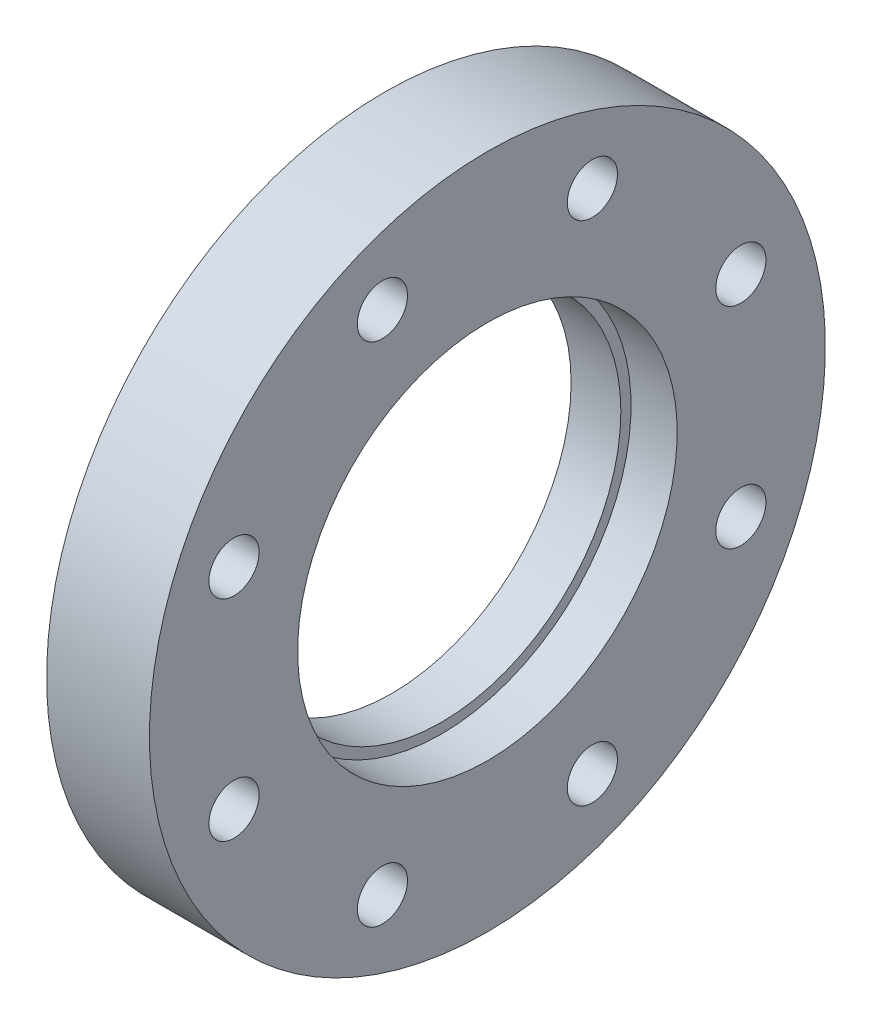
ISO-10303-21;
HEADER;
FILE_DESCRIPTION(('STEP AP214'),'2;1');
FILE_NAME('part.step','',(''),(''),'','','');
FILE_SCHEMA(('AUTOMOTIVE_DESIGN { 1 0 10303 214 1 1 1 1 }'));
ENDSEC;
DATA;
#1=APPLICATION_CONTEXT('core data for automotive mechanical design processes');
#2=APPLICATION_PROTOCOL_DEFINITION('international standard','automotive_design',2000,#1);
#3=PRODUCT_CONTEXT('',#1,'mechanical');
#4=PRODUCT('Part','Part','',(#3));
#5=PRODUCT_RELATED_PRODUCT_CATEGORY('part','',(#4));
#6=PRODUCT_DEFINITION_FORMATION('','',#4);
#7=PRODUCT_DEFINITION_CONTEXT('part definition',#1,'design');
#8=PRODUCT_DEFINITION('design','',#6,#7);
#9=PRODUCT_DEFINITION_SHAPE('','',#8);
#10=(LENGTH_UNIT() NAMED_UNIT(*) SI_UNIT(.MILLI.,.METRE.));
#11=(NAMED_UNIT(*) PLANE_ANGLE_UNIT() SI_UNIT($,.RADIAN.));
#12=(NAMED_UNIT(*) SI_UNIT($,.STERADIAN.) SOLID_ANGLE_UNIT());
#13=UNCERTAINTY_MEASURE_WITH_UNIT(LENGTH_MEASURE(1.E-05),#10,'distance_accuracy_value','');
#14=(GEOMETRIC_REPRESENTATION_CONTEXT(3) GLOBAL_UNCERTAINTY_ASSIGNED_CONTEXT((#13)) GLOBAL_UNIT_ASSIGNED_CONTEXT((#10,
#11,#12)) REPRESENTATION_CONTEXT('',''));
#15=CARTESIAN_POINT('',(0.,0.,0.));
#16=DIRECTION('',(0.,0.,1.));
#17=DIRECTION('',(1.,0.,0.));
#18=AXIS2_PLACEMENT_3D('',#15,#16,#17);
#19=CARTESIAN_POINT('',(0.893707741295802,0.,0.));
#20=DIRECTION('',(1.,0.,0.));
#21=DIRECTION('',(0.,1.,0.));
#22=AXIS2_PLACEMENT_3D('',#19,#20,#21);
#23=CYLINDRICAL_SURFACE('',#22,38.608);
#24=CARTESIAN_POINT('',(1.1700000000003,0.,0.));
#25=DIRECTION('',(1.,0.,0.));
#26=DIRECTION('',(0.,1.,0.));
#27=AXIS2_PLACEMENT_3D('',#24,#25,#26);
#28=CIRCLE('',#27,38.608);
#29=CARTESIAN_POINT('',(1.17000000000035,38.608,0.));
#30=VERTEX_POINT('',#29);
#31=EDGE_CURVE('E19',#30,#30,#28,.F.);
#32=ORIENTED_EDGE('',*,*,#31,.F.);
#33=EDGE_LOOP('',(#32));
#34=FACE_BOUND('',#33,.T.);
#35=CARTESIAN_POINT('',(0.617415480729711,0.,0.));
#36=DIRECTION('',(1.,0.,0.));
#37=DIRECTION('',(0.,1.,0.));
#38=AXIS2_PLACEMENT_3D('',#35,#36,#37);
#39=CIRCLE('',#38,38.6080000006776);
#40=CARTESIAN_POINT('',(0.617415480729764,38.6080000006776,0.));
#41=VERTEX_POINT('',#40);
#42=EDGE_CURVE('E102',#41,#41,#39,.T.);
#43=ORIENTED_EDGE('',*,*,#42,.F.);
#44=EDGE_LOOP('',(#43));
#45=FACE_BOUND('',#44,.T.);
#46=ADVANCED_FACE('F15',(#34,#45),#23,.F.);
#47=CARTESIAN_POINT('',(1.58812409924042,0.,0.));
#48=DIRECTION('',(1.,0.,0.));
#49=DIRECTION('',(0.,1.,0.));
#50=AXIS2_PLACEMENT_3D('',#47,#48,#49);
#51=CONICAL_SURFACE('',#50,41.2749999993224,1.22173047500015);
#52=ORIENTED_EDGE('',*,*,#42,.T.);
#53=EDGE_LOOP('',(#52));
#54=FACE_BOUND('',#53,.T.);
#55=CARTESIAN_POINT('',(1.58812409737882,0.,0.));
#56=DIRECTION('',(1.,0.,0.));
#57=DIRECTION('',(0.,1.,0.));
#58=AXIS2_PLACEMENT_3D('',#55,#56,#57);
#59=CIRCLE('',#58,41.275);
#60=CARTESIAN_POINT('',(1.58812409737888,41.275,0.));
#61=VERTEX_POINT('',#60);
#62=EDGE_CURVE('E94',#61,#61,#59,.F.);
#63=ORIENTED_EDGE('',*,*,#62,.T.);
#64=EDGE_LOOP('',(#63));
#65=FACE_BOUND('',#64,.T.);
#66=ADVANCED_FACE('F108',(#54,#65),#51,.T.);
#67=CARTESIAN_POINT('',(1.17000000000035,34.38525,0.));
#68=DIRECTION('',(-1.,0.,0.));
#69=DIRECTION('',(0.,0.,1.));
#70=AXIS2_PLACEMENT_3D('',#67,#68,#69);
#71=PLANE('',#70);
#72=CARTESIAN_POINT('',(1.17000000000031,0.,0.));
#73=DIRECTION('',(1.,0.,0.));
#74=DIRECTION('',(0.,1.,0.));
#75=AXIS2_PLACEMENT_3D('',#72,#73,#74);
#76=CIRCLE('',#75,30.1625);
#77=CARTESIAN_POINT('',(1.17000000000035,30.1625,0.));
#78=VERTEX_POINT('',#77);
#79=EDGE_CURVE('E92',#78,#78,#76,.T.);
#80=ORIENTED_EDGE('',*,*,#79,.T.);
#81=EDGE_LOOP('',(#80));
#82=FACE_BOUND('',#81,.T.);
#83=ORIENTED_EDGE('',*,*,#31,.T.);
#84=EDGE_LOOP('',(#83));
#85=FACE_BOUND('',#84,.T.);
#86=ADVANCED_FACE('F117',(#82,#85),#71,.T.);
#87=CARTESIAN_POINT('',(0.794062048689262,0.,0.));
#88=DIRECTION('',(1.,0.,0.));
#89=DIRECTION('',(0.,1.,0.));
#90=AXIS2_PLACEMENT_3D('',#87,#88,#89);
#91=CYLINDRICAL_SURFACE('',#90,41.275);
#92=ORIENTED_EDGE('',*,*,#62,.F.);
#93=EDGE_LOOP('',(#92));
#94=FACE_BOUND('',#93,.T.);
#95=CARTESIAN_POINT('',(-2.86879894839664E-13,0.,0.));
#96=DIRECTION('',(1.,0.,0.));
#97=DIRECTION('',(0.,1.,0.));
#98=AXIS2_PLACEMENT_3D('',#95,#96,#97);
#99=CIRCLE('',#98,41.275);
#100=CARTESIAN_POINT('',(-2.29051473539664E-13,41.275,0.));
#101=VERTEX_POINT('',#100);
#102=EDGE_CURVE('E90',#101,#101,#99,.T.);
#103=ORIENTED_EDGE('',*,*,#102,.F.);
#104=EDGE_LOOP('',(#103));
#105=FACE_BOUND('',#104,.T.);
#106=ADVANCED_FACE('F148',(#94,#105),#91,.F.);
#107=CARTESIAN_POINT('',(5.34750000000002,0.,0.));
#108=DIRECTION('',(1.,0.,0.));
#109=DIRECTION('',(0.,1.,0.));
#110=AXIS2_PLACEMENT_3D('',#107,#108,#109);
#111=CYLINDRICAL_SURFACE('',#110,30.1625);
#112=CARTESIAN_POINT('',(9.52499999999973,0.,0.));
#113=DIRECTION('',(1.,0.,0.));
#114=DIRECTION('',(0.,1.,0.));
#115=AXIS2_PLACEMENT_3D('',#112,#113,#114);
#116=CIRCLE('',#115,30.1625);
#117=CARTESIAN_POINT('',(9.52499999999977,30.1625,0.));
#118=VERTEX_POINT('',#117);
#119=EDGE_CURVE('E87',#118,#118,#116,.F.);
#120=ORIENTED_EDGE('',*,*,#119,.F.);
#121=EDGE_LOOP('',(#120));
#122=FACE_BOUND('',#121,.T.);
#123=ORIENTED_EDGE('',*,*,#79,.F.);
#124=EDGE_LOOP('',(#123));
#125=FACE_BOUND('',#124,.T.);
#126=ADVANCED_FACE('F144',(#122,#125),#111,.F.);
#127=CARTESIAN_POINT('',(-2.503946478E-13,49.0220000000002,0.));
#128=DIRECTION('',(-1.,0.,0.));
#129=DIRECTION('',(0.,0.,1.));
#130=AXIS2_PLACEMENT_3D('',#127,#128,#129);
#131=PLANE('',#130);
#132=ORIENTED_EDGE('',*,*,#102,.T.);
#133=EDGE_LOOP('',(#132));
#134=FACE_BOUND('',#133,.T.);
#135=CARTESIAN_POINT('',(-2.4980018054066E-13,17.632368756281,-42.568303788177));
#136=DIRECTION('',(-1.,0.,0.));
#137=DIRECTION('',(0.,-1.,0.));
#138=AXIS2_PLACEMENT_3D('',#135,#136,#137);
#139=CIRCLE('',#138,4.2164);
#140=CARTESIAN_POINT('',(-2.77555756156289E-13,13.4159687562811,-42.568303788177));
#141=VERTEX_POINT('',#140);
#142=EDGE_CURVE('E60',#141,#141,#139,.F.);
#143=ORIENTED_EDGE('',*,*,#142,.T.);
#144=EDGE_LOOP('',(#143));
#145=FACE_BOUND('',#144,.T.);
#146=CARTESIAN_POINT('',(-2.4980018054066E-13,-17.6323687562809,-42.5683037881771));
#147=DIRECTION('',(-1.,0.,0.));
#148=DIRECTION('',(0.,0.,1.));
#149=AXIS2_PLACEMENT_3D('',#146,#147,#148);
#150=CIRCLE('',#149,4.2164);
#151=CARTESIAN_POINT('',(-2.4980018054066E-13,-17.6323687562809,-38.3519037881771));
#152=VERTEX_POINT('',#151);
#153=EDGE_CURVE('E63',#152,#152,#150,.F.);
#154=ORIENTED_EDGE('',*,*,#153,.T.);
#155=EDGE_LOOP('',(#154));
#156=FACE_BOUND('',#155,.T.);
#157=CARTESIAN_POINT('',(-2.4980018054066E-13,42.568303788177,-17.6323687562809));
#158=DIRECTION('',(-1.,0.,0.));
#159=DIRECTION('',(0.,0.,1.));
#160=AXIS2_PLACEMENT_3D('',#157,#158,#159);
#161=CIRCLE('',#160,4.21639999999998);
#162=CARTESIAN_POINT('',(-2.4980018054066E-13,42.568303788177,-13.4159687562809));
#163=VERTEX_POINT('',#162);
#164=EDGE_CURVE('E66',#163,#163,#161,.F.);
#165=ORIENTED_EDGE('',*,*,#164,.T.);
#166=EDGE_LOOP('',(#165));
#167=FACE_BOUND('',#166,.T.);
#168=CARTESIAN_POINT('',(-2.4980018054066E-13,42.568303788177,17.632368756281));
#169=DIRECTION('',(-1.,0.,0.));
#170=DIRECTION('',(0.,0.,1.));
#171=AXIS2_PLACEMENT_3D('',#168,#169,#170);
#172=CIRCLE('',#171,4.2164);
#173=CARTESIAN_POINT('',(-2.4980018054066E-13,42.568303788177,21.848768756281));
#174=VERTEX_POINT('',#173);
#175=EDGE_CURVE('E69',#174,#174,#172,.F.);
#176=ORIENTED_EDGE('',*,*,#175,.T.);
#177=EDGE_LOOP('',(#176));
#178=FACE_BOUND('',#177,.T.);
#179=CARTESIAN_POINT('',(-2.4980018054066E-13,17.6323687562809,42.5683037881771));
#180=DIRECTION('',(-1.,0.,0.));
#181=DIRECTION('',(0.,0.,1.));
#182=AXIS2_PLACEMENT_3D('',#179,#180,#181);
#183=CIRCLE('',#182,4.2164);
#184=CARTESIAN_POINT('',(-2.4980018054066E-13,17.6323687562809,46.7847037881771));
#185=VERTEX_POINT('',#184);
#186=EDGE_CURVE('E72',#185,#185,#183,.F.);
#187=ORIENTED_EDGE('',*,*,#186,.T.);
#188=EDGE_LOOP('',(#187));
#189=FACE_BOUND('',#188,.T.);
#190=CARTESIAN_POINT('',(-2.4980018054066E-13,-17.632368756281,42.568303788177));
#191=DIRECTION('',(-1.,0.,0.));
#192=DIRECTION('',(0.,0.,1.));
#193=AXIS2_PLACEMENT_3D('',#190,#191,#192);
#194=CIRCLE('',#193,4.2164);
#195=CARTESIAN_POINT('',(-2.4980018054066E-13,-17.632368756281,46.784703788177));
#196=VERTEX_POINT('',#195);
#197=EDGE_CURVE('E75',#196,#196,#194,.F.);
#198=ORIENTED_EDGE('',*,*,#197,.T.);
#199=EDGE_LOOP('',(#198));
#200=FACE_BOUND('',#199,.T.);
#201=CARTESIAN_POINT('',(-2.4980018054066E-13,-42.5683037881771,17.6323687562809));
#202=DIRECTION('',(-1.,0.,0.));
#203=DIRECTION('',(0.,0.,1.));
#204=AXIS2_PLACEMENT_3D('',#201,#202,#203);
#205=CIRCLE('',#204,4.2164);
#206=CARTESIAN_POINT('',(-2.4980018054066E-13,-42.5683037881771,21.8487687562809));
#207=VERTEX_POINT('',#206);
#208=EDGE_CURVE('E78',#207,#207,#205,.F.);
#209=ORIENTED_EDGE('',*,*,#208,.T.);
#210=EDGE_LOOP('',(#209));
#211=FACE_BOUND('',#210,.T.);
#212=CARTESIAN_POINT('',(-2.4980018054066E-13,-42.5683037881771,-17.632368756281));
#213=DIRECTION('',(-1.,0.,0.));
#214=DIRECTION('',(0.,0.,1.));
#215=AXIS2_PLACEMENT_3D('',#212,#213,#214);
#216=CIRCLE('',#215,4.2164);
#217=CARTESIAN_POINT('',(-2.4980018054066E-13,-42.5683037881771,-13.415968756281));
#218=VERTEX_POINT('',#217);
#219=EDGE_CURVE('E81',#218,#218,#216,.F.);
#220=ORIENTED_EDGE('',*,*,#219,.T.);
#221=EDGE_LOOP('',(#220));
#222=FACE_BOUND('',#221,.T.);
#223=CARTESIAN_POINT('',(-3.52148865623292E-13,0.,0.));
#224=DIRECTION('',(1.,0.,0.));
#225=DIRECTION('',(0.,1.,0.));
#226=AXIS2_PLACEMENT_3D('',#223,#224,#225);
#227=CIRCLE('',#226,56.7690000000004);
#228=CARTESIAN_POINT('',(-2.72612544635291E-13,56.7690000000004,0.));
#229=VERTEX_POINT('',#228);
#230=EDGE_CURVE('E84',#229,#229,#227,.T.);
#231=ORIENTED_EDGE('',*,*,#230,.F.);
#232=EDGE_LOOP('',(#231));
#233=FACE_BOUND('',#232,.T.);
#234=ADVANCED_FACE('F140',(#134,#145,#156,#167,#178,#189,#200,#211,#222,#233),#131,.T.);
#235=CARTESIAN_POINT('',(9.52499999999977,31.01975,0.));
#236=DIRECTION('',(1.,0.,0.));
#237=DIRECTION('',(0.,0.,-1.));
#238=AXIS2_PLACEMENT_3D('',#235,#236,#237);
#239=PLANE('',#238);
#240=ORIENTED_EDGE('',*,*,#119,.T.);
#241=EDGE_LOOP('',(#240));
#242=FACE_BOUND('',#241,.T.);
#243=CARTESIAN_POINT('',(9.52499999999973,0.,0.));
#244=DIRECTION('',(1.,0.,0.));
#245=DIRECTION('',(0.,1.,0.));
#246=AXIS2_PLACEMENT_3D('',#243,#244,#245);
#247=CIRCLE('',#246,31.877);
#248=CARTESIAN_POINT('',(9.52499999999977,31.877,0.));
#249=VERTEX_POINT('',#248);
#250=EDGE_CURVE('E57',#249,#249,#247,.T.);
#251=ORIENTED_EDGE('',*,*,#250,.T.);
#252=EDGE_LOOP('',(#251));
#253=FACE_BOUND('',#252,.T.);
#254=ADVANCED_FACE('F136',(#242,#253),#239,.T.);
#255=CARTESIAN_POINT('',(8.6359999999999,0.,0.));
#256=DIRECTION('',(1.,0.,0.));
#257=DIRECTION('',(0.,1.,0.));
#258=AXIS2_PLACEMENT_3D('',#255,#256,#257);
#259=CYLINDRICAL_SURFACE('',#258,56.7690000000004);
#260=ORIENTED_EDGE('',*,*,#230,.T.);
#261=EDGE_LOOP('',(#260));
#262=FACE_BOUND('',#261,.T.);
#263=CARTESIAN_POINT('',(17.2720000000001,0.,0.));
#264=DIRECTION('',(1.,0.,0.));
#265=DIRECTION('',(0.,1.,0.));
#266=AXIS2_PLACEMENT_3D('',#263,#264,#265);
#267=CIRCLE('',#266,56.7690000000004);
#268=CARTESIAN_POINT('',(17.2720000000002,56.7690000000003,0.));
#269=VERTEX_POINT('',#268);
#270=EDGE_CURVE('E54',#269,#269,#267,.T.);
#271=ORIENTED_EDGE('',*,*,#270,.F.);
#272=EDGE_LOOP('',(#271));
#273=FACE_BOUND('',#272,.T.);
#274=ADVANCED_FACE('F132',(#262,#273),#259,.T.);
#275=CARTESIAN_POINT('',(17.2720000000002,-42.5683037881771,-17.632368756281));
#276=DIRECTION('',(-1.,0.,0.));
#277=DIRECTION('',(0.,0.,1.));
#278=AXIS2_PLACEMENT_3D('',#275,#276,#277);
#279=CYLINDRICAL_SURFACE('',#278,4.2164);
#280=CARTESIAN_POINT('',(17.2720000000002,-42.5683037881771,-17.632368756281));
#281=DIRECTION('',(-1.,0.,0.));
#282=DIRECTION('',(0.,0.,1.));
#283=AXIS2_PLACEMENT_3D('',#280,#281,#282);
#284=CIRCLE('',#283,4.2164);
#285=CARTESIAN_POINT('',(17.2720000000002,-42.5683037881771,-13.415968756281));
#286=VERTEX_POINT('',#285);
#287=EDGE_CURVE('E51',#286,#286,#284,.T.);
#288=ORIENTED_EDGE('',*,*,#287,.F.);
#289=EDGE_LOOP('',(#288));
#290=FACE_BOUND('',#289,.T.);
#291=ORIENTED_EDGE('',*,*,#219,.F.);
#292=EDGE_LOOP('',(#291));
#293=FACE_BOUND('',#292,.T.);
#294=ADVANCED_FACE('F135',(#290,#293),#279,.F.);
#295=CARTESIAN_POINT('',(17.2720000000002,-42.5683037881771,17.6323687562809));
#296=DIRECTION('',(-1.,0.,0.));
#297=DIRECTION('',(0.,0.,1.));
#298=AXIS2_PLACEMENT_3D('',#295,#296,#297);
#299=CYLINDRICAL_SURFACE('',#298,4.2164);
#300=CARTESIAN_POINT('',(17.2720000000002,-42.5683037881771,17.6323687562809));
#301=DIRECTION('',(-1.,0.,0.));
#302=DIRECTION('',(0.,0.,1.));
#303=AXIS2_PLACEMENT_3D('',#300,#301,#302);
#304=CIRCLE('',#303,4.2164);
#305=CARTESIAN_POINT('',(17.2720000000002,-42.5683037881771,21.8487687562809));
#306=VERTEX_POINT('',#305);
#307=EDGE_CURVE('E48',#306,#306,#304,.T.);
#308=ORIENTED_EDGE('',*,*,#307,.F.);
#309=EDGE_LOOP('',(#308));
#310=FACE_BOUND('',#309,.T.);
#311=ORIENTED_EDGE('',*,*,#208,.F.);
#312=EDGE_LOOP('',(#311));
#313=FACE_BOUND('',#312,.T.);
#314=ADVANCED_FACE('F187',(#310,#313),#299,.F.);
#315=CARTESIAN_POINT('',(17.2720000000002,-17.632368756281,42.568303788177));
#316=DIRECTION('',(-1.,0.,0.));
#317=DIRECTION('',(0.,0.,1.));
#318=AXIS2_PLACEMENT_3D('',#315,#316,#317);
#319=CYLINDRICAL_SURFACE('',#318,4.2164);
#320=CARTESIAN_POINT('',(17.2720000000002,-17.632368756281,42.568303788177));
#321=DIRECTION('',(-1.,0.,0.));
#322=DIRECTION('',(0.,0.,1.));
#323=AXIS2_PLACEMENT_3D('',#320,#321,#322);
#324=CIRCLE('',#323,4.2164);
#325=CARTESIAN_POINT('',(17.2720000000002,-17.632368756281,46.784703788177));
#326=VERTEX_POINT('',#325);
#327=EDGE_CURVE('E45',#326,#326,#324,.T.);
#328=ORIENTED_EDGE('',*,*,#327,.F.);
#329=EDGE_LOOP('',(#328));
#330=FACE_BOUND('',#329,.T.);
#331=ORIENTED_EDGE('',*,*,#197,.F.);
#332=EDGE_LOOP('',(#331));
#333=FACE_BOUND('',#332,.T.);
#334=ADVANCED_FACE('F194',(#330,#333),#319,.F.);
#335=CARTESIAN_POINT('',(17.2720000000002,17.6323687562809,42.5683037881771));
#336=DIRECTION('',(-1.,0.,0.));
#337=DIRECTION('',(0.,0.,1.));
#338=AXIS2_PLACEMENT_3D('',#335,#336,#337);
#339=CYLINDRICAL_SURFACE('',#338,4.2164);
#340=CARTESIAN_POINT('',(17.2720000000002,17.6323687562809,42.5683037881771));
#341=DIRECTION('',(-1.,0.,0.));
#342=DIRECTION('',(0.,0.,1.));
#343=AXIS2_PLACEMENT_3D('',#340,#341,#342);
#344=CIRCLE('',#343,4.2164);
#345=CARTESIAN_POINT('',(17.2720000000002,17.6323687562809,46.7847037881771));
#346=VERTEX_POINT('',#345);
#347=EDGE_CURVE('E42',#346,#346,#344,.T.);
#348=ORIENTED_EDGE('',*,*,#347,.F.);
#349=EDGE_LOOP('',(#348));
#350=FACE_BOUND('',#349,.T.);
#351=ORIENTED_EDGE('',*,*,#186,.F.);
#352=EDGE_LOOP('',(#351));
#353=FACE_BOUND('',#352,.T.);
#354=ADVANCED_FACE('F202',(#350,#353),#339,.F.);
#355=CARTESIAN_POINT('',(17.2720000000002,42.568303788177,17.632368756281));
#356=DIRECTION('',(-1.,0.,0.));
#357=DIRECTION('',(0.,0.,1.));
#358=AXIS2_PLACEMENT_3D('',#355,#356,#357);
#359=CYLINDRICAL_SURFACE('',#358,4.2164);
#360=CARTESIAN_POINT('',(17.2720000000002,42.568303788177,17.632368756281));
#361=DIRECTION('',(-1.,0.,0.));
#362=DIRECTION('',(0.,0.,1.));
#363=AXIS2_PLACEMENT_3D('',#360,#361,#362);
#364=CIRCLE('',#363,4.2164);
#365=CARTESIAN_POINT('',(17.2720000000002,42.568303788177,21.848768756281));
#366=VERTEX_POINT('',#365);
#367=EDGE_CURVE('E39',#366,#366,#364,.T.);
#368=ORIENTED_EDGE('',*,*,#367,.F.);
#369=EDGE_LOOP('',(#368));
#370=FACE_BOUND('',#369,.T.);
#371=ORIENTED_EDGE('',*,*,#175,.F.);
#372=EDGE_LOOP('',(#371));
#373=FACE_BOUND('',#372,.T.);
#374=ADVANCED_FACE('F210',(#370,#373),#359,.F.);
#375=CARTESIAN_POINT('',(17.2720000000002,42.568303788177,-17.6323687562809));
#376=DIRECTION('',(-1.,0.,0.));
#377=DIRECTION('',(0.,0.,1.));
#378=AXIS2_PLACEMENT_3D('',#375,#376,#377);
#379=CYLINDRICAL_SURFACE('',#378,4.21639999999998);
#380=CARTESIAN_POINT('',(17.2720000000002,42.568303788177,-17.6323687562809));
#381=DIRECTION('',(-1.,0.,0.));
#382=DIRECTION('',(0.,0.,1.));
#383=AXIS2_PLACEMENT_3D('',#380,#381,#382);
#384=CIRCLE('',#383,4.21639999999998);
#385=CARTESIAN_POINT('',(17.2720000000002,42.568303788177,-13.4159687562809));
#386=VERTEX_POINT('',#385);
#387=EDGE_CURVE('E36',#386,#386,#384,.T.);
#388=ORIENTED_EDGE('',*,*,#387,.F.);
#389=EDGE_LOOP('',(#388));
#390=FACE_BOUND('',#389,.T.);
#391=ORIENTED_EDGE('',*,*,#164,.F.);
#392=EDGE_LOOP('',(#391));
#393=FACE_BOUND('',#392,.T.);
#394=ADVANCED_FACE('F218',(#390,#393),#379,.F.);
#395=CARTESIAN_POINT('',(17.2720000000002,-17.6323687562809,-42.5683037881771));
#396=DIRECTION('',(-1.,0.,0.));
#397=DIRECTION('',(0.,0.,1.));
#398=AXIS2_PLACEMENT_3D('',#395,#396,#397);
#399=CYLINDRICAL_SURFACE('',#398,4.2164);
#400=CARTESIAN_POINT('',(17.2720000000002,-17.6323687562809,-42.5683037881771));
#401=DIRECTION('',(-1.,0.,0.));
#402=DIRECTION('',(0.,0.,1.));
#403=AXIS2_PLACEMENT_3D('',#400,#401,#402);
#404=CIRCLE('',#403,4.2164);
#405=CARTESIAN_POINT('',(17.2720000000002,-17.6323687562809,-38.3519037881771));
#406=VERTEX_POINT('',#405);
#407=EDGE_CURVE('E28',#406,#406,#404,.T.);
#408=ORIENTED_EDGE('',*,*,#407,.F.);
#409=EDGE_LOOP('',(#408));
#410=FACE_BOUND('',#409,.T.);
#411=ORIENTED_EDGE('',*,*,#153,.F.);
#412=EDGE_LOOP('',(#411));
#413=FACE_BOUND('',#412,.T.);
#414=ADVANCED_FACE('F226',(#410,#413),#399,.F.);
#415=CARTESIAN_POINT('',(17.2720000000002,17.6323687562809,-42.568303788177));
#416=DIRECTION('',(-1.,0.,0.));
#417=DIRECTION('',(0.,-1.,0.));
#418=AXIS2_PLACEMENT_3D('',#415,#416,#417);
#419=CYLINDRICAL_SURFACE('',#418,4.2164);
#420=CARTESIAN_POINT('',(17.2720000000002,17.6323687562809,-42.568303788177));
#421=DIRECTION('',(-1.,0.,0.));
#422=DIRECTION('',(0.,-1.,0.));
#423=AXIS2_PLACEMENT_3D('',#420,#421,#422);
#424=CIRCLE('',#423,4.2164);
#425=CARTESIAN_POINT('',(17.2720000000002,13.4159687562809,-42.568303788177));
#426=VERTEX_POINT('',#425);
#427=EDGE_CURVE('E23',#426,#426,#424,.T.);
#428=ORIENTED_EDGE('',*,*,#427,.F.);
#429=EDGE_LOOP('',(#428));
#430=FACE_BOUND('',#429,.T.);
#431=ORIENTED_EDGE('',*,*,#142,.F.);
#432=EDGE_LOOP('',(#431));
#433=FACE_BOUND('',#432,.T.);
#434=ADVANCED_FACE('F17',(#430,#433),#419,.F.);
#435=CARTESIAN_POINT('',(13.3985,0.,0.));
#436=DIRECTION('',(1.,0.,0.));
#437=DIRECTION('',(0.,1.,0.));
#438=AXIS2_PLACEMENT_3D('',#435,#436,#437);
#439=CYLINDRICAL_SURFACE('',#438,31.877);
#440=CARTESIAN_POINT('',(17.2720000000002,0.,0.));
#441=DIRECTION('',(1.,0.,0.));
#442=DIRECTION('',(0.,1.,0.));
#443=AXIS2_PLACEMENT_3D('',#440,#441,#442);
#444=CIRCLE('',#443,31.877);
#445=CARTESIAN_POINT('',(17.2720000000003,31.877,0.));
#446=VERTEX_POINT('',#445);
#447=EDGE_CURVE('E10',#446,#446,#444,.F.);
#448=ORIENTED_EDGE('',*,*,#447,.F.);
#449=EDGE_LOOP('',(#448));
#450=FACE_BOUND('',#449,.T.);
#451=ORIENTED_EDGE('',*,*,#250,.F.);
#452=EDGE_LOOP('',(#451));
#453=FACE_BOUND('',#452,.T.);
#454=ADVANCED_FACE('F123',(#450,#453),#439,.F.);
#455=CARTESIAN_POINT('',(17.2720000000002,44.3230000000002,0.));
#456=DIRECTION('',(1.,0.,0.));
#457=DIRECTION('',(0.,0.,-1.));
#458=AXIS2_PLACEMENT_3D('',#455,#456,#457);
#459=PLANE('',#458);
#460=ORIENTED_EDGE('',*,*,#447,.T.);
#461=EDGE_LOOP('',(#460));
#462=FACE_BOUND('',#461,.T.);
#463=ORIENTED_EDGE('',*,*,#427,.T.);
#464=EDGE_LOOP('',(#463));
#465=FACE_BOUND('',#464,.T.);
#466=ORIENTED_EDGE('',*,*,#407,.T.);
#467=EDGE_LOOP('',(#466));
#468=FACE_BOUND('',#467,.T.);
#469=ORIENTED_EDGE('',*,*,#387,.T.);
#470=EDGE_LOOP('',(#469));
#471=FACE_BOUND('',#470,.T.);
#472=ORIENTED_EDGE('',*,*,#367,.T.);
#473=EDGE_LOOP('',(#472));
#474=FACE_BOUND('',#473,.T.);
#475=ORIENTED_EDGE('',*,*,#347,.T.);
#476=EDGE_LOOP('',(#475));
#477=FACE_BOUND('',#476,.T.);
#478=ORIENTED_EDGE('',*,*,#327,.T.);
#479=EDGE_LOOP('',(#478));
#480=FACE_BOUND('',#479,.T.);
#481=ORIENTED_EDGE('',*,*,#307,.T.);
#482=EDGE_LOOP('',(#481));
#483=FACE_BOUND('',#482,.T.);
#484=ORIENTED_EDGE('',*,*,#287,.T.);
#485=EDGE_LOOP('',(#484));
#486=FACE_BOUND('',#485,.T.);
#487=ORIENTED_EDGE('',*,*,#270,.T.);
#488=EDGE_LOOP('',(#487));
#489=FACE_BOUND('',#488,.T.);
#490=ADVANCED_FACE('F121',(#462,#465,#468,#471,#474,#477,#480,#483,#486,#489),#459,.T.);
#491=CLOSED_SHELL('',(#46,#66,#86,#106,#126,#234,#254,#274,#294,#314,#334,#354,#374,#394,#414,
#434,#454,#490));
#492=MANIFOLD_SOLID_BREP('B1',#491);
#493=ADVANCED_BREP_SHAPE_REPRESENTATION('',(#18,#492),#14);
#494=SHAPE_DEFINITION_REPRESENTATION(#9,#493);
ENDSEC;
END-ISO-10303-21;
